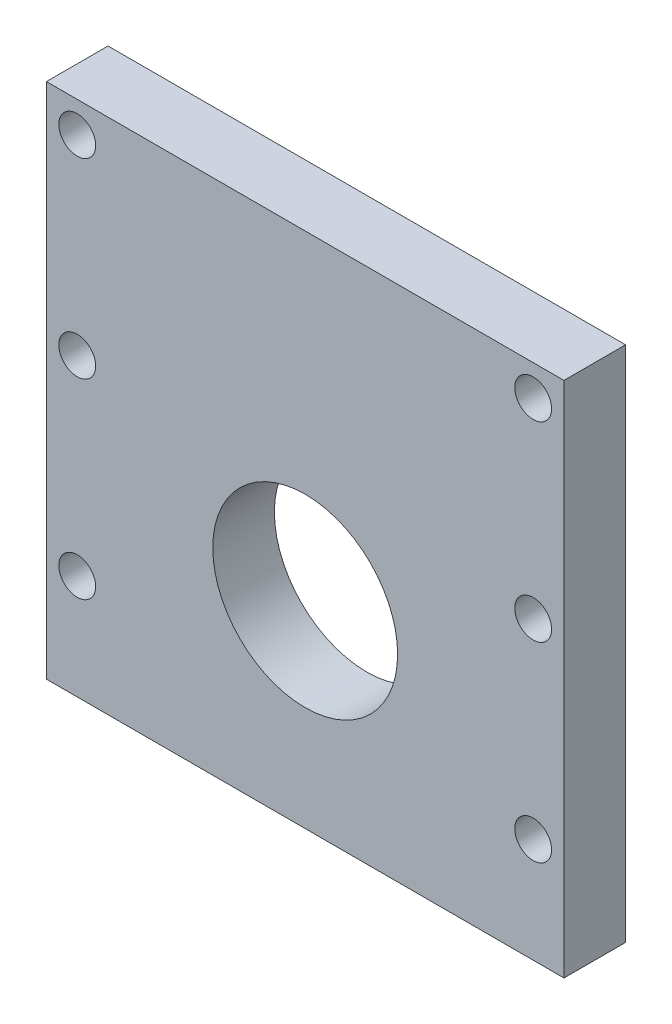
ISO-10303-21;
HEADER;
FILE_DESCRIPTION(('STEP AP214'),'2;1');
FILE_NAME('part.step','',(''),(''),'','','');
FILE_SCHEMA(('AUTOMOTIVE_DESIGN { 1 0 10303 214 1 1 1 1 }'));
ENDSEC;
DATA;
#1=APPLICATION_CONTEXT('core data for automotive mechanical design processes');
#2=APPLICATION_PROTOCOL_DEFINITION('international standard','automotive_design',2000,#1);
#3=PRODUCT_CONTEXT('',#1,'mechanical');
#4=PRODUCT('Part','Part','',(#3));
#5=PRODUCT_RELATED_PRODUCT_CATEGORY('part','',(#4));
#6=PRODUCT_DEFINITION_FORMATION('','',#4);
#7=PRODUCT_DEFINITION_CONTEXT('part definition',#1,'design');
#8=PRODUCT_DEFINITION('design','',#6,#7);
#9=PRODUCT_DEFINITION_SHAPE('','',#8);
#10=(LENGTH_UNIT() NAMED_UNIT(*) SI_UNIT(.MILLI.,.METRE.));
#11=(NAMED_UNIT(*) PLANE_ANGLE_UNIT() SI_UNIT($,.RADIAN.));
#12=(NAMED_UNIT(*) SI_UNIT($,.STERADIAN.) SOLID_ANGLE_UNIT());
#13=UNCERTAINTY_MEASURE_WITH_UNIT(LENGTH_MEASURE(1.E-05),#10,'distance_accuracy_value','');
#14=(GEOMETRIC_REPRESENTATION_CONTEXT(3) GLOBAL_UNCERTAINTY_ASSIGNED_CONTEXT((#13)) GLOBAL_UNIT_ASSIGNED_CONTEXT((#10,
#11,#12)) REPRESENTATION_CONTEXT('',''));
#15=CARTESIAN_POINT('',(0.,0.,0.));
#16=DIRECTION('',(0.,0.,1.));
#17=DIRECTION('',(1.,0.,0.));
#18=AXIS2_PLACEMENT_3D('',#15,#16,#17);
#19=CARTESIAN_POINT('',(0.,0.,6.35));
#20=DIRECTION('',(0.,0.,-1.));
#21=DIRECTION('',(-1.,0.,0.));
#22=AXIS2_PLACEMENT_3D('',#19,#20,#21);
#23=PLANE('',#22);
#24=CARTESIAN_POINT('',(50.165,50.165,6.35));
#25=DIRECTION('',(0.,0.,1.));
#26=DIRECTION('',(1.,0.,0.));
#27=AXIS2_PLACEMENT_3D('',#24,#25,#26);
#28=CIRCLE('',#27,1.89864999999999);
#29=CARTESIAN_POINT('',(52.06365,50.165,6.35));
#30=VERTEX_POINT('',#29);
#31=EDGE_CURVE('E151',#30,#30,#28,.T.);
#32=ORIENTED_EDGE('',*,*,#31,.F.);
#33=EDGE_LOOP('',(#32));
#34=FACE_BOUND('',#33,.T.);
#35=CARTESIAN_POINT('',(50.165,10.795,6.35));
#36=DIRECTION('',(0.,0.,1.));
#37=DIRECTION('',(1.,0.,0.));
#38=AXIS2_PLACEMENT_3D('',#35,#36,#37);
#39=CIRCLE('',#38,1.89864999999999);
#40=CARTESIAN_POINT('',(52.06365,10.795,6.35));
#41=VERTEX_POINT('',#40);
#42=EDGE_CURVE('E145',#41,#41,#39,.T.);
#43=ORIENTED_EDGE('',*,*,#42,.F.);
#44=EDGE_LOOP('',(#43));
#45=FACE_BOUND('',#44,.T.);
#46=CARTESIAN_POINT('',(3.175,10.795,6.35));
#47=DIRECTION('',(0.,0.,1.));
#48=DIRECTION('',(1.,0.,0.));
#49=AXIS2_PLACEMENT_3D('',#46,#47,#48);
#50=CIRCLE('',#49,1.89864999999999);
#51=CARTESIAN_POINT('',(5.07364999999998,10.795,6.35));
#52=VERTEX_POINT('',#51);
#53=EDGE_CURVE('E139',#52,#52,#50,.T.);
#54=ORIENTED_EDGE('',*,*,#53,.F.);
#55=EDGE_LOOP('',(#54));
#56=FACE_BOUND('',#55,.T.);
#57=CARTESIAN_POINT('',(3.175,30.48,6.35));
#58=DIRECTION('',(0.,0.,1.));
#59=DIRECTION('',(1.,0.,0.));
#60=AXIS2_PLACEMENT_3D('',#57,#58,#59);
#61=CIRCLE('',#60,1.89864999999999);
#62=CARTESIAN_POINT('',(5.07364999999998,30.48,6.35));
#63=VERTEX_POINT('',#62);
#64=EDGE_CURVE('E133',#63,#63,#61,.T.);
#65=ORIENTED_EDGE('',*,*,#64,.F.);
#66=EDGE_LOOP('',(#65));
#67=FACE_BOUND('',#66,.T.);
#68=CARTESIAN_POINT('',(50.165,30.48,6.35));
#69=DIRECTION('',(0.,0.,1.));
#70=DIRECTION('',(1.,0.,0.));
#71=AXIS2_PLACEMENT_3D('',#68,#69,#70);
#72=CIRCLE('',#71,1.89864999999999);
#73=CARTESIAN_POINT('',(52.06365,30.48,6.35));
#74=VERTEX_POINT('',#73);
#75=EDGE_CURVE('E127',#74,#74,#72,.T.);
#76=ORIENTED_EDGE('',*,*,#75,.F.);
#77=EDGE_LOOP('',(#76));
#78=FACE_BOUND('',#77,.T.);
#79=CARTESIAN_POINT('',(26.67,20.32,6.35));
#80=DIRECTION('',(0.,0.,-1.));
#81=DIRECTION('',(-1.,0.,0.));
#82=AXIS2_PLACEMENT_3D('',#79,#80,#81);
#83=CIRCLE('',#82,9.52500000000001);
#84=CARTESIAN_POINT('',(17.145,20.32,6.35));
#85=VERTEX_POINT('',#84);
#86=EDGE_CURVE('E106',#85,#85,#83,.T.);
#87=ORIENTED_EDGE('',*,*,#86,.T.);
#88=EDGE_LOOP('',(#87));
#89=FACE_BOUND('',#88,.T.);
#90=DIRECTION('',(0.,-1.,0.));
#91=VECTOR('',#90,1.);
#92=CARTESIAN_POINT('',(0.,0.,6.35));
#93=LINE('',#92,#91);
#94=CARTESIAN_POINT('',(0.,53.34,6.35));
#95=VERTEX_POINT('',#94);
#96=CARTESIAN_POINT('',(0.,0.,6.35));
#97=VERTEX_POINT('',#96);
#98=EDGE_CURVE('E90',#95,#97,#93,.T.);
#99=ORIENTED_EDGE('',*,*,#98,.T.);
#100=DIRECTION('',(1.,0.,0.));
#101=VECTOR('',#100,1.);
#102=CARTESIAN_POINT('',(0.,0.,6.35));
#103=LINE('',#102,#101);
#104=CARTESIAN_POINT('',(53.34,0.,6.35));
#105=VERTEX_POINT('',#104);
#106=EDGE_CURVE('E85',#97,#105,#103,.T.);
#107=ORIENTED_EDGE('',*,*,#106,.T.);
#108=DIRECTION('',(0.,1.,0.));
#109=VECTOR('',#108,1.);
#110=CARTESIAN_POINT('',(53.34,0.,6.35));
#111=LINE('',#110,#109);
#112=CARTESIAN_POINT('',(53.34,53.34,6.35));
#113=VERTEX_POINT('',#112);
#114=EDGE_CURVE('E88',#105,#113,#111,.T.);
#115=ORIENTED_EDGE('',*,*,#114,.T.);
#116=DIRECTION('',(-1.,0.,0.));
#117=VECTOR('',#116,1.);
#118=CARTESIAN_POINT('',(0.,53.34,6.35));
#119=LINE('',#118,#117);
#120=EDGE_CURVE('E55',#113,#95,#119,.T.);
#121=ORIENTED_EDGE('',*,*,#120,.T.);
#122=EDGE_LOOP('',(#99,#107,#115,#121));
#123=FACE_BOUND('',#122,.T.);
#124=CARTESIAN_POINT('',(3.175,50.165,6.35));
#125=DIRECTION('',(0.,0.,1.));
#126=DIRECTION('',(1.,0.,0.));
#127=AXIS2_PLACEMENT_3D('',#124,#125,#126);
#128=CIRCLE('',#127,1.89864999999999);
#129=CARTESIAN_POINT('',(5.07364999999999,50.165,6.35));
#130=VERTEX_POINT('',#129);
#131=EDGE_CURVE('E157',#130,#130,#128,.T.);
#132=ORIENTED_EDGE('',*,*,#131,.F.);
#133=EDGE_LOOP('',(#132));
#134=FACE_BOUND('',#133,.T.);
#135=ADVANCED_FACE('F38',(#34,#45,#56,#67,#78,#89,#123,#134),#23,.F.);
#136=CARTESIAN_POINT('',(0.,0.,6.35));
#137=DIRECTION('',(1.,0.,0.));
#138=DIRECTION('',(0.,0.,-1.));
#139=AXIS2_PLACEMENT_3D('',#136,#137,#138);
#140=PLANE('',#139);
#141=DIRECTION('',(0.,-1.,0.));
#142=VECTOR('',#141,1.);
#143=CARTESIAN_POINT('',(0.,0.,0.));
#144=LINE('',#143,#142);
#145=CARTESIAN_POINT('',(0.,53.34,0.));
#146=VERTEX_POINT('',#145);
#147=CARTESIAN_POINT('',(0.,0.,0.));
#148=VERTEX_POINT('',#147);
#149=EDGE_CURVE('E103',#146,#148,#144,.T.);
#150=ORIENTED_EDGE('',*,*,#149,.T.);
#151=DIRECTION('',(0.,0.,-1.));
#152=VECTOR('',#151,1.);
#153=CARTESIAN_POINT('',(0.,0.,6.35));
#154=LINE('',#153,#152);
#155=EDGE_CURVE('E11',#97,#148,#154,.T.);
#156=ORIENTED_EDGE('',*,*,#155,.F.);
#157=ORIENTED_EDGE('',*,*,#98,.F.);
#158=DIRECTION('',(0.,0.,-1.));
#159=VECTOR('',#158,1.);
#160=CARTESIAN_POINT('',(0.,53.34,6.35));
#161=LINE('',#160,#159);
#162=EDGE_CURVE('E99',#95,#146,#161,.T.);
#163=ORIENTED_EDGE('',*,*,#162,.T.);
#164=EDGE_LOOP('',(#150,#156,#157,#163));
#165=FACE_BOUND('',#164,.T.);
#166=ADVANCED_FACE('F40',(#165),#140,.F.);
#167=CARTESIAN_POINT('',(0.,0.,6.35));
#168=DIRECTION('',(0.,1.,0.));
#169=DIRECTION('',(0.,0.,1.));
#170=AXIS2_PLACEMENT_3D('',#167,#168,#169);
#171=PLANE('',#170);
#172=DIRECTION('',(1.,0.,0.));
#173=VECTOR('',#172,1.);
#174=CARTESIAN_POINT('',(0.,0.,0.));
#175=LINE('',#174,#173);
#176=CARTESIAN_POINT('',(53.34,0.,0.));
#177=VERTEX_POINT('',#176);
#178=EDGE_CURVE('E95',#148,#177,#175,.T.);
#179=ORIENTED_EDGE('',*,*,#178,.T.);
#180=DIRECTION('',(0.,0.,-1.));
#181=VECTOR('',#180,1.);
#182=CARTESIAN_POINT('',(53.34,0.,6.35));
#183=LINE('',#182,#181);
#184=EDGE_CURVE('E47',#105,#177,#183,.T.);
#185=ORIENTED_EDGE('',*,*,#184,.F.);
#186=ORIENTED_EDGE('',*,*,#106,.F.);
#187=ORIENTED_EDGE('',*,*,#155,.T.);
#188=EDGE_LOOP('',(#179,#185,#186,#187));
#189=FACE_BOUND('',#188,.T.);
#190=ADVANCED_FACE('F94',(#189),#171,.F.);
#191=CARTESIAN_POINT('',(53.34,0.,6.35));
#192=DIRECTION('',(-1.,0.,0.));
#193=DIRECTION('',(0.,0.,1.));
#194=AXIS2_PLACEMENT_3D('',#191,#192,#193);
#195=PLANE('',#194);
#196=DIRECTION('',(0.,1.,0.));
#197=VECTOR('',#196,1.);
#198=CARTESIAN_POINT('',(53.34,0.,0.));
#199=LINE('',#198,#197);
#200=CARTESIAN_POINT('',(53.34,53.34,0.));
#201=VERTEX_POINT('',#200);
#202=EDGE_CURVE('E72',#177,#201,#199,.T.);
#203=ORIENTED_EDGE('',*,*,#202,.T.);
#204=DIRECTION('',(0.,0.,-1.));
#205=VECTOR('',#204,1.);
#206=CARTESIAN_POINT('',(53.34,53.34,6.35));
#207=LINE('',#206,#205);
#208=EDGE_CURVE('E96',#113,#201,#207,.T.);
#209=ORIENTED_EDGE('',*,*,#208,.F.);
#210=ORIENTED_EDGE('',*,*,#114,.F.);
#211=ORIENTED_EDGE('',*,*,#184,.T.);
#212=EDGE_LOOP('',(#203,#209,#210,#211));
#213=FACE_BOUND('',#212,.T.);
#214=ADVANCED_FACE('F97',(#213),#195,.F.);
#215=CARTESIAN_POINT('',(0.,53.34,6.35));
#216=DIRECTION('',(0.,-1.,0.));
#217=DIRECTION('',(0.,0.,-1.));
#218=AXIS2_PLACEMENT_3D('',#215,#216,#217);
#219=PLANE('',#218);
#220=DIRECTION('',(-1.,0.,0.));
#221=VECTOR('',#220,1.);
#222=CARTESIAN_POINT('',(0.,53.34,0.));
#223=LINE('',#222,#221);
#224=EDGE_CURVE('E78',#201,#146,#223,.T.);
#225=ORIENTED_EDGE('',*,*,#224,.T.);
#226=ORIENTED_EDGE('',*,*,#162,.F.);
#227=ORIENTED_EDGE('',*,*,#120,.F.);
#228=ORIENTED_EDGE('',*,*,#208,.T.);
#229=EDGE_LOOP('',(#225,#226,#227,#228));
#230=FACE_BOUND('',#229,.T.);
#231=ADVANCED_FACE('F112',(#230),#219,.F.);
#232=CARTESIAN_POINT('',(0.,0.,0.));
#233=DIRECTION('',(0.,0.,-1.));
#234=DIRECTION('',(-1.,0.,0.));
#235=AXIS2_PLACEMENT_3D('',#232,#233,#234);
#236=PLANE('',#235);
#237=CARTESIAN_POINT('',(3.175,50.165,0.));
#238=DIRECTION('',(0.,0.,-1.));
#239=DIRECTION('',(-1.,0.,0.));
#240=AXIS2_PLACEMENT_3D('',#237,#238,#239);
#241=CIRCLE('',#240,1.89864999999999);
#242=CARTESIAN_POINT('',(1.27635000000001,50.165,0.));
#243=VERTEX_POINT('',#242);
#244=EDGE_CURVE('E154',#243,#243,#241,.T.);
#245=ORIENTED_EDGE('',*,*,#244,.F.);
#246=EDGE_LOOP('',(#245));
#247=FACE_BOUND('',#246,.T.);
#248=CARTESIAN_POINT('',(50.165,50.165,0.));
#249=DIRECTION('',(0.,0.,-1.));
#250=DIRECTION('',(-1.,0.,0.));
#251=AXIS2_PLACEMENT_3D('',#248,#249,#250);
#252=CIRCLE('',#251,1.89864999999999);
#253=CARTESIAN_POINT('',(48.26635,50.165,0.));
#254=VERTEX_POINT('',#253);
#255=EDGE_CURVE('E148',#254,#254,#252,.T.);
#256=ORIENTED_EDGE('',*,*,#255,.F.);
#257=EDGE_LOOP('',(#256));
#258=FACE_BOUND('',#257,.T.);
#259=CARTESIAN_POINT('',(50.165,10.795,0.));
#260=DIRECTION('',(0.,0.,-1.));
#261=DIRECTION('',(-1.,0.,0.));
#262=AXIS2_PLACEMENT_3D('',#259,#260,#261);
#263=CIRCLE('',#262,1.89864999999999);
#264=CARTESIAN_POINT('',(48.26635,10.795,0.));
#265=VERTEX_POINT('',#264);
#266=EDGE_CURVE('E142',#265,#265,#263,.T.);
#267=ORIENTED_EDGE('',*,*,#266,.F.);
#268=EDGE_LOOP('',(#267));
#269=FACE_BOUND('',#268,.T.);
#270=CARTESIAN_POINT('',(3.175,10.795,0.));
#271=DIRECTION('',(0.,0.,-1.));
#272=DIRECTION('',(-1.,0.,0.));
#273=AXIS2_PLACEMENT_3D('',#270,#271,#272);
#274=CIRCLE('',#273,1.89864999999999);
#275=CARTESIAN_POINT('',(1.27635,10.795,0.));
#276=VERTEX_POINT('',#275);
#277=EDGE_CURVE('E136',#276,#276,#274,.T.);
#278=ORIENTED_EDGE('',*,*,#277,.F.);
#279=EDGE_LOOP('',(#278));
#280=FACE_BOUND('',#279,.T.);
#281=CARTESIAN_POINT('',(3.175,30.48,0.));
#282=DIRECTION('',(0.,0.,-1.));
#283=DIRECTION('',(-1.,0.,0.));
#284=AXIS2_PLACEMENT_3D('',#281,#282,#283);
#285=CIRCLE('',#284,1.89864999999999);
#286=CARTESIAN_POINT('',(1.27635,30.48,0.));
#287=VERTEX_POINT('',#286);
#288=EDGE_CURVE('E130',#287,#287,#285,.T.);
#289=ORIENTED_EDGE('',*,*,#288,.F.);
#290=EDGE_LOOP('',(#289));
#291=FACE_BOUND('',#290,.T.);
#292=CARTESIAN_POINT('',(50.165,30.48,0.));
#293=DIRECTION('',(0.,0.,-1.));
#294=DIRECTION('',(-1.,0.,0.));
#295=AXIS2_PLACEMENT_3D('',#292,#293,#294);
#296=CIRCLE('',#295,1.89864999999999);
#297=CARTESIAN_POINT('',(48.26635,30.48,0.));
#298=VERTEX_POINT('',#297);
#299=EDGE_CURVE('E124',#298,#298,#296,.T.);
#300=ORIENTED_EDGE('',*,*,#299,.F.);
#301=EDGE_LOOP('',(#300));
#302=FACE_BOUND('',#301,.T.);
#303=CARTESIAN_POINT('',(26.67,20.32,0.));
#304=DIRECTION('',(0.,0.,1.));
#305=DIRECTION('',(1.,0.,0.));
#306=AXIS2_PLACEMENT_3D('',#303,#304,#305);
#307=CIRCLE('',#306,9.52500000000001);
#308=CARTESIAN_POINT('',(36.195,20.32,0.));
#309=VERTEX_POINT('',#308);
#310=EDGE_CURVE('E120',#309,#309,#307,.T.);
#311=ORIENTED_EDGE('',*,*,#310,.T.);
#312=EDGE_LOOP('',(#311));
#313=FACE_BOUND('',#312,.T.);
#314=ORIENTED_EDGE('',*,*,#149,.F.);
#315=ORIENTED_EDGE('',*,*,#224,.F.);
#316=ORIENTED_EDGE('',*,*,#202,.F.);
#317=ORIENTED_EDGE('',*,*,#178,.F.);
#318=EDGE_LOOP('',(#314,#315,#316,#317));
#319=FACE_BOUND('',#318,.T.);
#320=ADVANCED_FACE('F115',(#247,#258,#269,#280,#291,#302,#313,#319),#236,.T.);
#321=CARTESIAN_POINT('',(26.67,20.32,0.));
#322=DIRECTION('',(0.,0.,1.));
#323=DIRECTION('',(1.,0.,0.));
#324=AXIS2_PLACEMENT_3D('',#321,#322,#323);
#325=CYLINDRICAL_SURFACE('',#324,9.52500000000001);
#326=ORIENTED_EDGE('',*,*,#310,.F.);
#327=EDGE_LOOP('',(#326));
#328=FACE_BOUND('',#327,.T.);
#329=ORIENTED_EDGE('',*,*,#86,.F.);
#330=EDGE_LOOP('',(#329));
#331=FACE_BOUND('',#330,.T.);
#332=ADVANCED_FACE('F173',(#328,#331),#325,.F.);
#333=CARTESIAN_POINT('',(50.165,30.48,6.35));
#334=DIRECTION('',(0.,0.,1.));
#335=DIRECTION('',(1.,0.,0.));
#336=AXIS2_PLACEMENT_3D('',#333,#334,#335);
#337=CYLINDRICAL_SURFACE('',#336,1.89864999999999);
#338=ORIENTED_EDGE('',*,*,#75,.T.);
#339=EDGE_LOOP('',(#338));
#340=FACE_BOUND('',#339,.T.);
#341=ORIENTED_EDGE('',*,*,#299,.T.);
#342=EDGE_LOOP('',(#341));
#343=FACE_BOUND('',#342,.T.);
#344=ADVANCED_FACE('F202',(#340,#343),#337,.F.);
#345=CARTESIAN_POINT('',(3.175,30.48,6.35));
#346=DIRECTION('',(0.,0.,1.));
#347=DIRECTION('',(1.,0.,0.));
#348=AXIS2_PLACEMENT_3D('',#345,#346,#347);
#349=CYLINDRICAL_SURFACE('',#348,1.89864999999999);
#350=ORIENTED_EDGE('',*,*,#64,.T.);
#351=EDGE_LOOP('',(#350));
#352=FACE_BOUND('',#351,.T.);
#353=ORIENTED_EDGE('',*,*,#288,.T.);
#354=EDGE_LOOP('',(#353));
#355=FACE_BOUND('',#354,.T.);
#356=ADVANCED_FACE('F209',(#352,#355),#349,.F.);
#357=CARTESIAN_POINT('',(3.175,10.795,6.35));
#358=DIRECTION('',(0.,0.,1.));
#359=DIRECTION('',(1.,0.,0.));
#360=AXIS2_PLACEMENT_3D('',#357,#358,#359);
#361=CYLINDRICAL_SURFACE('',#360,1.89864999999999);
#362=ORIENTED_EDGE('',*,*,#53,.T.);
#363=EDGE_LOOP('',(#362));
#364=FACE_BOUND('',#363,.T.);
#365=ORIENTED_EDGE('',*,*,#277,.T.);
#366=EDGE_LOOP('',(#365));
#367=FACE_BOUND('',#366,.T.);
#368=ADVANCED_FACE('F216',(#364,#367),#361,.F.);
#369=CARTESIAN_POINT('',(50.165,10.795,6.35));
#370=DIRECTION('',(0.,0.,1.));
#371=DIRECTION('',(1.,0.,0.));
#372=AXIS2_PLACEMENT_3D('',#369,#370,#371);
#373=CYLINDRICAL_SURFACE('',#372,1.89864999999999);
#374=ORIENTED_EDGE('',*,*,#42,.T.);
#375=EDGE_LOOP('',(#374));
#376=FACE_BOUND('',#375,.T.);
#377=ORIENTED_EDGE('',*,*,#266,.T.);
#378=EDGE_LOOP('',(#377));
#379=FACE_BOUND('',#378,.T.);
#380=ADVANCED_FACE('F224',(#376,#379),#373,.F.);
#381=CARTESIAN_POINT('',(50.165,50.165,6.35));
#382=DIRECTION('',(0.,0.,1.));
#383=DIRECTION('',(1.,0.,0.));
#384=AXIS2_PLACEMENT_3D('',#381,#382,#383);
#385=CYLINDRICAL_SURFACE('',#384,1.89864999999999);
#386=ORIENTED_EDGE('',*,*,#31,.T.);
#387=EDGE_LOOP('',(#386));
#388=FACE_BOUND('',#387,.T.);
#389=ORIENTED_EDGE('',*,*,#255,.T.);
#390=EDGE_LOOP('',(#389));
#391=FACE_BOUND('',#390,.T.);
#392=ADVANCED_FACE('F232',(#388,#391),#385,.F.);
#393=CARTESIAN_POINT('',(3.175,50.165,6.35));
#394=DIRECTION('',(0.,0.,1.));
#395=DIRECTION('',(1.,0.,0.));
#396=AXIS2_PLACEMENT_3D('',#393,#394,#395);
#397=CYLINDRICAL_SURFACE('',#396,1.89864999999999);
#398=ORIENTED_EDGE('',*,*,#131,.T.);
#399=EDGE_LOOP('',(#398));
#400=FACE_BOUND('',#399,.T.);
#401=ORIENTED_EDGE('',*,*,#244,.T.);
#402=EDGE_LOOP('',(#401));
#403=FACE_BOUND('',#402,.T.);
#404=ADVANCED_FACE('F161',(#400,#403),#397,.F.);
#405=CLOSED_SHELL('',(#135,#166,#190,#214,#231,#320,#332,#344,#356,#368,#380,#392,#404));
#406=MANIFOLD_SOLID_BREP('B2',#405);
#407=ADVANCED_BREP_SHAPE_REPRESENTATION('',(#18,#406),#14);
#408=SHAPE_DEFINITION_REPRESENTATION(#9,#407);
ENDSEC;
END-ISO-10303-21;
